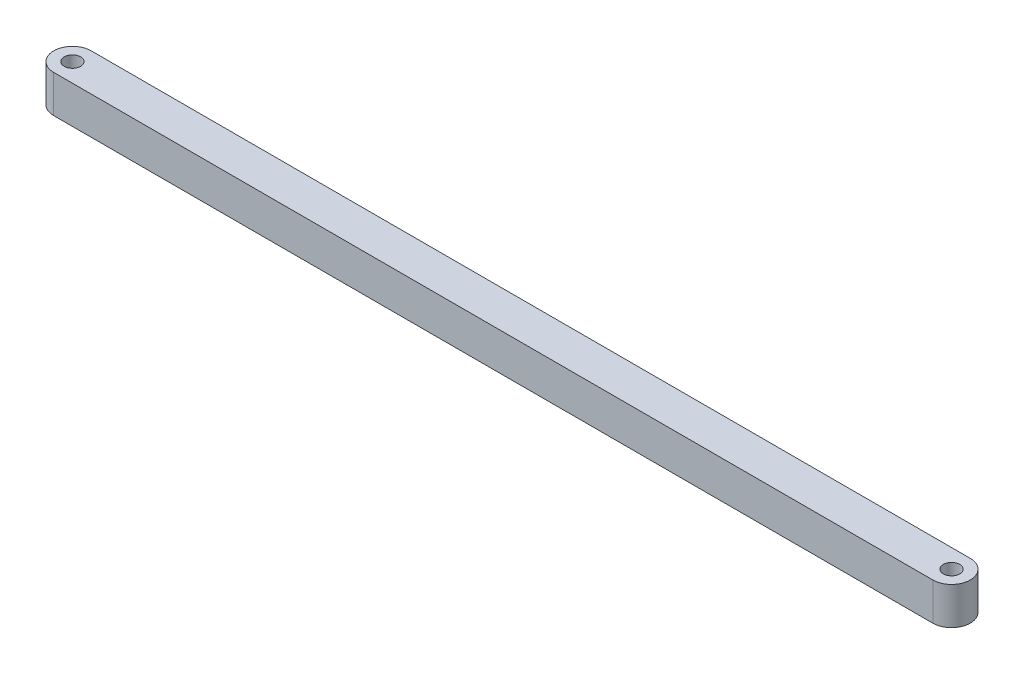
ISO-10303-21;
HEADER;
FILE_DESCRIPTION(('STEP AP214'),'2;1');
FILE_NAME('part.step','',(''),(''),'','','');
FILE_SCHEMA(('AUTOMOTIVE_DESIGN { 1 0 10303 214 1 1 1 1 }'));
ENDSEC;
DATA;
#1=APPLICATION_CONTEXT('core data for automotive mechanical design processes');
#2=APPLICATION_PROTOCOL_DEFINITION('international standard','automotive_design',2000,#1);
#3=PRODUCT_CONTEXT('',#1,'mechanical');
#4=PRODUCT('Part','Part','',(#3));
#5=PRODUCT_RELATED_PRODUCT_CATEGORY('part','',(#4));
#6=PRODUCT_DEFINITION_FORMATION('','',#4);
#7=PRODUCT_DEFINITION_CONTEXT('part definition',#1,'design');
#8=PRODUCT_DEFINITION('design','',#6,#7);
#9=PRODUCT_DEFINITION_SHAPE('','',#8);
#10=(LENGTH_UNIT() NAMED_UNIT(*) SI_UNIT(.MILLI.,.METRE.));
#11=(NAMED_UNIT(*) PLANE_ANGLE_UNIT() SI_UNIT($,.RADIAN.));
#12=(NAMED_UNIT(*) SI_UNIT($,.STERADIAN.) SOLID_ANGLE_UNIT());
#13=UNCERTAINTY_MEASURE_WITH_UNIT(LENGTH_MEASURE(1.E-05),#10,'distance_accuracy_value','');
#14=(GEOMETRIC_REPRESENTATION_CONTEXT(3) GLOBAL_UNCERTAINTY_ASSIGNED_CONTEXT((#13)) GLOBAL_UNIT_ASSIGNED_CONTEXT((#10,
#11,#12)) REPRESENTATION_CONTEXT('',''));
#15=CARTESIAN_POINT('',(0.,0.,0.));
#16=DIRECTION('',(0.,0.,1.));
#17=DIRECTION('',(1.,0.,0.));
#18=AXIS2_PLACEMENT_3D('',#15,#16,#17);
#19=CARTESIAN_POINT('',(-58.7,5.,0.));
#20=DIRECTION('',(0.,1.,0.));
#21=DIRECTION('',(0.,0.,1.));
#22=AXIS2_PLACEMENT_3D('',#19,#20,#21);
#23=PLANE('',#22);
#24=CARTESIAN_POINT('',(-58.7,5.,0.));
#25=DIRECTION('',(0.,1.,0.));
#26=DIRECTION('',(0.,0.,1.));
#27=AXIS2_PLACEMENT_3D('',#24,#25,#26);
#28=CIRCLE('',#27,1.1);
#29=CARTESIAN_POINT('',(-58.7,5.,1.1));
#30=VERTEX_POINT('',#29);
#31=EDGE_CURVE('E116',#30,#30,#28,.T.);
#32=ORIENTED_EDGE('',*,*,#31,.F.);
#33=EDGE_LOOP('',(#32));
#34=FACE_BOUND('',#33,.T.);
#35=CARTESIAN_POINT('',(-58.7,5.,0.));
#36=DIRECTION('',(0.,1.,0.));
#37=DIRECTION('',(0.,0.,1.));
#38=AXIS2_PLACEMENT_3D('',#35,#36,#37);
#39=CIRCLE('',#38,2.5);
#40=CARTESIAN_POINT('',(-58.7,5.,-2.5));
#41=VERTEX_POINT('',#40);
#42=CARTESIAN_POINT('',(-58.7,5.,2.5));
#43=VERTEX_POINT('',#42);
#44=EDGE_CURVE('E96',#41,#43,#39,.T.);
#45=ORIENTED_EDGE('',*,*,#44,.T.);
#46=DIRECTION('',(0.999999999999923,0.,-3.92178380075793E-07));
#47=VECTOR('',#46,1.);
#48=CARTESIAN_POINT('',(58.684828419991,5.,2.49995396420815));
#49=LINE('',#48,#47);
#50=CARTESIAN_POINT('',(58.684828419991,5.,2.49995396420815));
#51=VERTEX_POINT('',#50);
#52=EDGE_CURVE('E91',#43,#51,#49,.T.);
#53=ORIENTED_EDGE('',*,*,#52,.T.);
#54=CARTESIAN_POINT('',(58.684828419991,5.,-4.60357918530621E-05));
#55=DIRECTION('',(0.,1.,0.));
#56=DIRECTION('',(0.,0.,1.));
#57=AXIS2_PLACEMENT_3D('',#54,#55,#56);
#58=CIRCLE('',#57,2.5);
#59=CARTESIAN_POINT('',(58.7,5.,-2.5));
#60=VERTEX_POINT('',#59);
#61=EDGE_CURVE('E94',#51,#60,#58,.T.);
#62=ORIENTED_EDGE('',*,*,#61,.T.);
#63=DIRECTION('',(-1.,0.,0.));
#64=VECTOR('',#63,1.);
#65=CARTESIAN_POINT('',(-58.7,5.,-2.5));
#66=LINE('',#65,#64);
#67=EDGE_CURVE('E61',#60,#41,#66,.T.);
#68=ORIENTED_EDGE('',*,*,#67,.T.);
#69=EDGE_LOOP('',(#45,#53,#62,#68));
#70=FACE_BOUND('',#69,.T.);
#71=CARTESIAN_POINT('',(58.684828419991,5.,-4.60357918530621E-05));
#72=DIRECTION('',(0.,1.,0.));
#73=DIRECTION('',(0.,0.,1.));
#74=AXIS2_PLACEMENT_3D('',#71,#72,#73);
#75=CIRCLE('',#74,1.1);
#76=CARTESIAN_POINT('',(58.684828419991,5.,1.09995396420815));
#77=VERTEX_POINT('',#76);
#78=EDGE_CURVE('E138',#77,#77,#75,.T.);
#79=ORIENTED_EDGE('',*,*,#78,.F.);
#80=EDGE_LOOP('',(#79));
#81=FACE_BOUND('',#80,.T.);
#82=ADVANCED_FACE('F43',(#34,#70,#81),#23,.T.);
#83=CARTESIAN_POINT('',(-58.7,0.,0.));
#84=DIRECTION('',(0.,1.,0.));
#85=DIRECTION('',(0.,0.,1.));
#86=AXIS2_PLACEMENT_3D('',#83,#84,#85);
#87=PLANE('',#86);
#88=CARTESIAN_POINT('',(-58.7,0.,0.));
#89=DIRECTION('',(0.,1.,0.));
#90=DIRECTION('',(0.,0.,1.));
#91=AXIS2_PLACEMENT_3D('',#88,#89,#90);
#92=CIRCLE('',#91,2.5);
#93=CARTESIAN_POINT('',(-58.7,0.,-2.5));
#94=VERTEX_POINT('',#93);
#95=CARTESIAN_POINT('',(-58.7,0.,2.5));
#96=VERTEX_POINT('',#95);
#97=EDGE_CURVE('E112',#94,#96,#92,.T.);
#98=ORIENTED_EDGE('',*,*,#97,.F.);
#99=DIRECTION('',(-1.,0.,0.));
#100=VECTOR('',#99,1.);
#101=CARTESIAN_POINT('',(-58.7,0.,-2.5));
#102=LINE('',#101,#100);
#103=CARTESIAN_POINT('',(58.7,0.,-2.5));
#104=VERTEX_POINT('',#103);
#105=EDGE_CURVE('E84',#104,#94,#102,.T.);
#106=ORIENTED_EDGE('',*,*,#105,.F.);
#107=CARTESIAN_POINT('',(58.684828419991,0.,-4.60357918530621E-05));
#108=DIRECTION('',(0.,1.,0.));
#109=DIRECTION('',(0.,0.,1.));
#110=AXIS2_PLACEMENT_3D('',#107,#108,#109);
#111=CIRCLE('',#110,2.5);
#112=CARTESIAN_POINT('',(58.684828419991,0.,2.49995396420815));
#113=VERTEX_POINT('',#112);
#114=EDGE_CURVE('E78',#113,#104,#111,.T.);
#115=ORIENTED_EDGE('',*,*,#114,.F.);
#116=DIRECTION('',(0.999999999999923,0.,-3.92178380075793E-07));
#117=VECTOR('',#116,1.);
#118=CARTESIAN_POINT('',(58.684828419991,0.,2.49995396420815));
#119=LINE('',#118,#117);
#120=EDGE_CURVE('E101',#96,#113,#119,.T.);
#121=ORIENTED_EDGE('',*,*,#120,.F.);
#122=EDGE_LOOP('',(#98,#106,#115,#121));
#123=FACE_BOUND('',#122,.T.);
#124=CARTESIAN_POINT('',(-58.7,0.,0.));
#125=DIRECTION('',(0.,1.,0.));
#126=DIRECTION('',(0.,0.,1.));
#127=AXIS2_PLACEMENT_3D('',#124,#125,#126);
#128=CIRCLE('',#127,1.1);
#129=CARTESIAN_POINT('',(-58.7,0.,1.1));
#130=VERTEX_POINT('',#129);
#131=EDGE_CURVE('E134',#130,#130,#128,.T.);
#132=ORIENTED_EDGE('',*,*,#131,.T.);
#133=EDGE_LOOP('',(#132));
#134=FACE_BOUND('',#133,.T.);
#135=CARTESIAN_POINT('',(58.684828419991,0.,-4.60357918530621E-05));
#136=DIRECTION('',(0.,1.,0.));
#137=DIRECTION('',(0.,0.,1.));
#138=AXIS2_PLACEMENT_3D('',#135,#136,#137);
#139=CIRCLE('',#138,1.1);
#140=CARTESIAN_POINT('',(58.684828419991,0.,1.09995396420815));
#141=VERTEX_POINT('',#140);
#142=EDGE_CURVE('E142',#141,#141,#139,.T.);
#143=ORIENTED_EDGE('',*,*,#142,.T.);
#144=EDGE_LOOP('',(#143));
#145=FACE_BOUND('',#144,.T.);
#146=ADVANCED_FACE('F129',(#123,#134,#145),#87,.F.);
#147=CARTESIAN_POINT('',(-58.7,5.,0.));
#148=DIRECTION('',(0.,-1.,0.));
#149=DIRECTION('',(0.,0.,-1.));
#150=AXIS2_PLACEMENT_3D('',#147,#148,#149);
#151=CYLINDRICAL_SURFACE('',#150,2.5);
#152=ORIENTED_EDGE('',*,*,#97,.T.);
#153=DIRECTION('',(0.,-1.,0.));
#154=VECTOR('',#153,1.);
#155=CARTESIAN_POINT('',(-58.7,5.,2.5));
#156=LINE('',#155,#154);
#157=EDGE_CURVE('E11',#43,#96,#156,.T.);
#158=ORIENTED_EDGE('',*,*,#157,.F.);
#159=ORIENTED_EDGE('',*,*,#44,.F.);
#160=DIRECTION('',(0.,-1.,0.));
#161=VECTOR('',#160,1.);
#162=CARTESIAN_POINT('',(-58.7,5.,-2.5));
#163=LINE('',#162,#161);
#164=EDGE_CURVE('E108',#41,#94,#163,.T.);
#165=ORIENTED_EDGE('',*,*,#164,.T.);
#166=EDGE_LOOP('',(#152,#158,#159,#165));
#167=FACE_BOUND('',#166,.T.);
#168=ADVANCED_FACE('F45',(#167),#151,.T.);
#169=CARTESIAN_POINT('',(58.684828419991,5.,2.49995396420815));
#170=DIRECTION('',(-3.92178380075793E-07,0.,-0.999999999999923));
#171=DIRECTION('',(-0.999999999999923,0.,3.92178380075793E-07));
#172=AXIS2_PLACEMENT_3D('',#169,#170,#171);
#173=PLANE('',#172);
#174=ORIENTED_EDGE('',*,*,#120,.T.);
#175=DIRECTION('',(0.,-1.,0.));
#176=VECTOR('',#175,1.);
#177=CARTESIAN_POINT('',(58.684828419991,5.,2.49995396420815));
#178=LINE('',#177,#176);
#179=EDGE_CURVE('E53',#51,#113,#178,.T.);
#180=ORIENTED_EDGE('',*,*,#179,.F.);
#181=ORIENTED_EDGE('',*,*,#52,.F.);
#182=ORIENTED_EDGE('',*,*,#157,.T.);
#183=EDGE_LOOP('',(#174,#180,#181,#182));
#184=FACE_BOUND('',#183,.T.);
#185=ADVANCED_FACE('F100',(#184),#173,.F.);
#186=CARTESIAN_POINT('',(58.684828419991,5.,-4.60357918530621E-05));
#187=DIRECTION('',(0.,-1.,0.));
#188=DIRECTION('',(0.,0.,-1.));
#189=AXIS2_PLACEMENT_3D('',#186,#187,#188);
#190=CYLINDRICAL_SURFACE('',#189,2.5);
#191=ORIENTED_EDGE('',*,*,#114,.T.);
#192=DIRECTION('',(0.,-1.,0.));
#193=VECTOR('',#192,1.);
#194=CARTESIAN_POINT('',(58.7,5.,-2.5));
#195=LINE('',#194,#193);
#196=EDGE_CURVE('E103',#60,#104,#195,.T.);
#197=ORIENTED_EDGE('',*,*,#196,.F.);
#198=ORIENTED_EDGE('',*,*,#61,.F.);
#199=ORIENTED_EDGE('',*,*,#179,.T.);
#200=EDGE_LOOP('',(#191,#197,#198,#199));
#201=FACE_BOUND('',#200,.T.);
#202=ADVANCED_FACE('F104',(#201),#190,.T.);
#203=CARTESIAN_POINT('',(-58.7,5.,-2.5));
#204=DIRECTION('',(0.,0.,1.));
#205=DIRECTION('',(1.,0.,0.));
#206=AXIS2_PLACEMENT_3D('',#203,#204,#205);
#207=PLANE('',#206);
#208=ORIENTED_EDGE('',*,*,#105,.T.);
#209=ORIENTED_EDGE('',*,*,#164,.F.);
#210=ORIENTED_EDGE('',*,*,#67,.F.);
#211=ORIENTED_EDGE('',*,*,#196,.T.);
#212=EDGE_LOOP('',(#208,#209,#210,#211));
#213=FACE_BOUND('',#212,.T.);
#214=ADVANCED_FACE('F126',(#213),#207,.F.);
#215=CARTESIAN_POINT('',(-58.7,5.,0.));
#216=DIRECTION('',(0.,-1.,0.));
#217=DIRECTION('',(0.,0.,-1.));
#218=AXIS2_PLACEMENT_3D('',#215,#216,#217);
#219=CYLINDRICAL_SURFACE('',#218,1.1);
#220=ORIENTED_EDGE('',*,*,#31,.T.);
#221=EDGE_LOOP('',(#220));
#222=FACE_BOUND('',#221,.T.);
#223=ORIENTED_EDGE('',*,*,#131,.F.);
#224=EDGE_LOOP('',(#223));
#225=FACE_BOUND('',#224,.T.);
#226=ADVANCED_FACE('F161',(#222,#225),#219,.F.);
#227=CARTESIAN_POINT('',(58.684828419991,5.,-4.60357918530621E-05));
#228=DIRECTION('',(0.,-1.,0.));
#229=DIRECTION('',(0.,0.,-1.));
#230=AXIS2_PLACEMENT_3D('',#227,#228,#229);
#231=CYLINDRICAL_SURFACE('',#230,1.1);
#232=ORIENTED_EDGE('',*,*,#78,.T.);
#233=EDGE_LOOP('',(#232));
#234=FACE_BOUND('',#233,.T.);
#235=ORIENTED_EDGE('',*,*,#142,.F.);
#236=EDGE_LOOP('',(#235));
#237=FACE_BOUND('',#236,.T.);
#238=ADVANCED_FACE('F150',(#234,#237),#231,.F.);
#239=CLOSED_SHELL('',(#82,#146,#168,#185,#202,#214,#226,#238));
#240=MANIFOLD_SOLID_BREP('B2',#239);
#241=ADVANCED_BREP_SHAPE_REPRESENTATION('',(#18,#240),#14);
#242=SHAPE_DEFINITION_REPRESENTATION(#9,#241);
ENDSEC;
END-ISO-10303-21;
